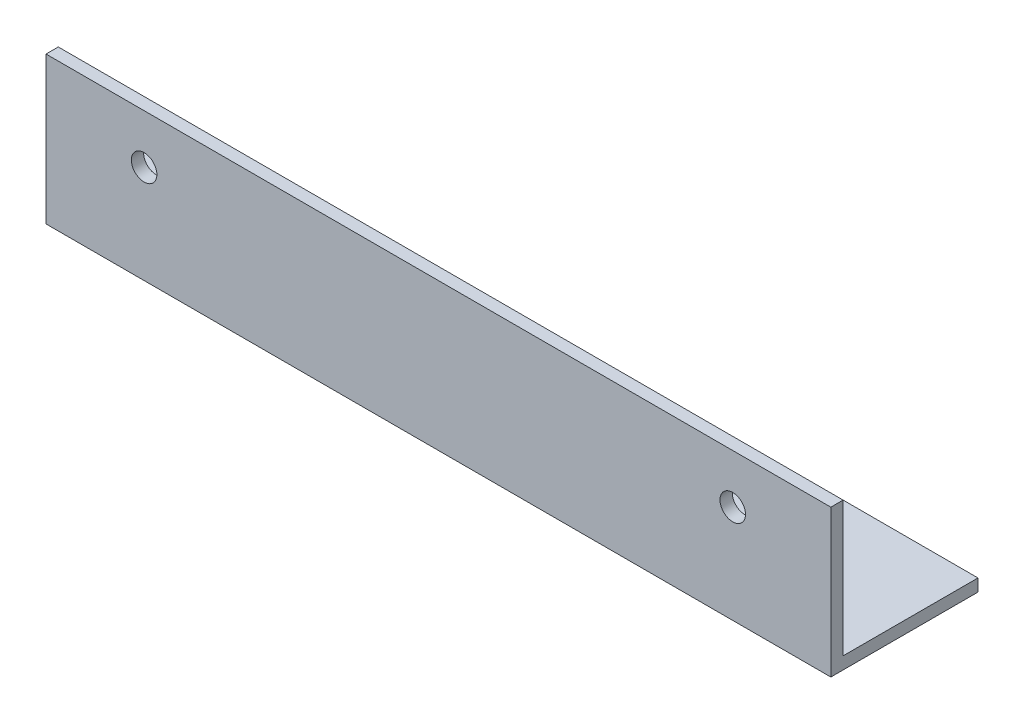
ISO-10303-21;
HEADER;
FILE_DESCRIPTION(('STEP AP214'),'2;1');
FILE_NAME('part.step','',(''),(''),'','','');
FILE_SCHEMA(('AUTOMOTIVE_DESIGN { 1 0 10303 214 1 1 1 1 }'));
ENDSEC;
DATA;
#1=APPLICATION_CONTEXT('core data for automotive mechanical design processes');
#2=APPLICATION_PROTOCOL_DEFINITION('international standard','automotive_design',2000,#1);
#3=PRODUCT_CONTEXT('',#1,'mechanical');
#4=PRODUCT('Part','Part','',(#3));
#5=PRODUCT_RELATED_PRODUCT_CATEGORY('part','',(#4));
#6=PRODUCT_DEFINITION_FORMATION('','',#4);
#7=PRODUCT_DEFINITION_CONTEXT('part definition',#1,'design');
#8=PRODUCT_DEFINITION('design','',#6,#7);
#9=PRODUCT_DEFINITION_SHAPE('','',#8);
#10=(LENGTH_UNIT() NAMED_UNIT(*) SI_UNIT(.MILLI.,.METRE.));
#11=(NAMED_UNIT(*) PLANE_ANGLE_UNIT() SI_UNIT($,.RADIAN.));
#12=(NAMED_UNIT(*) SI_UNIT($,.STERADIAN.) SOLID_ANGLE_UNIT());
#13=UNCERTAINTY_MEASURE_WITH_UNIT(LENGTH_MEASURE(1.E-05),#10,'distance_accuracy_value','');
#14=(GEOMETRIC_REPRESENTATION_CONTEXT(3) GLOBAL_UNCERTAINTY_ASSIGNED_CONTEXT((#13)) GLOBAL_UNIT_ASSIGNED_CONTEXT((#10,
#11,#12)) REPRESENTATION_CONTEXT('',''));
#15=CARTESIAN_POINT('',(0.,0.,0.));
#16=DIRECTION('',(0.,0.,1.));
#17=DIRECTION('',(1.,0.,0.));
#18=AXIS2_PLACEMENT_3D('',#15,#16,#17);
#19=CARTESIAN_POINT('',(76.2,25.4,-3.175));
#20=DIRECTION('',(0.,0.,1.));
#21=DIRECTION('',(1.,0.,0.));
#22=AXIS2_PLACEMENT_3D('',#19,#20,#21);
#23=CYLINDRICAL_SURFACE('',#22,3.302);
#24=CARTESIAN_POINT('',(76.2,25.4,-3.175));
#25=DIRECTION('',(0.,0.,1.));
#26=DIRECTION('',(1.,0.,0.));
#27=AXIS2_PLACEMENT_3D('',#24,#25,#26);
#28=CIRCLE('',#27,3.302);
#29=CARTESIAN_POINT('',(79.502,25.4,-3.175));
#30=VERTEX_POINT('',#29);
#31=EDGE_CURVE('E20',#30,#30,#28,.T.);
#32=ORIENTED_EDGE('',*,*,#31,.F.);
#33=EDGE_LOOP('',(#32));
#34=FACE_BOUND('',#33,.T.);
#35=CARTESIAN_POINT('',(76.2,25.4,0.));
#36=DIRECTION('',(0.,0.,1.));
#37=DIRECTION('',(1.,0.,0.));
#38=AXIS2_PLACEMENT_3D('',#35,#36,#37);
#39=CIRCLE('',#38,3.302);
#40=CARTESIAN_POINT('',(79.502,25.4,0.));
#41=VERTEX_POINT('',#40);
#42=EDGE_CURVE('E103',#41,#41,#39,.F.);
#43=ORIENTED_EDGE('',*,*,#42,.F.);
#44=EDGE_LOOP('',(#43));
#45=FACE_BOUND('',#44,.T.);
#46=ADVANCED_FACE('F17',(#34,#45),#23,.F.);
#47=CARTESIAN_POINT('',(-76.2,25.4,-3.175));
#48=DIRECTION('',(0.,0.,1.));
#49=DIRECTION('',(1.,0.,0.));
#50=AXIS2_PLACEMENT_3D('',#47,#48,#49);
#51=CYLINDRICAL_SURFACE('',#50,3.302);
#52=CARTESIAN_POINT('',(-76.2,25.4,-3.175));
#53=DIRECTION('',(0.,0.,1.));
#54=DIRECTION('',(1.,0.,0.));
#55=AXIS2_PLACEMENT_3D('',#52,#53,#54);
#56=CIRCLE('',#55,3.302);
#57=CARTESIAN_POINT('',(-72.898,25.4,-3.175));
#58=VERTEX_POINT('',#57);
#59=EDGE_CURVE('E98',#58,#58,#56,.T.);
#60=ORIENTED_EDGE('',*,*,#59,.F.);
#61=EDGE_LOOP('',(#60));
#62=FACE_BOUND('',#61,.T.);
#63=CARTESIAN_POINT('',(-76.2,25.4,0.));
#64=DIRECTION('',(0.,0.,1.));
#65=DIRECTION('',(1.,0.,0.));
#66=AXIS2_PLACEMENT_3D('',#63,#64,#65);
#67=CIRCLE('',#66,3.302);
#68=CARTESIAN_POINT('',(-72.898,25.4,0.));
#69=VERTEX_POINT('',#68);
#70=EDGE_CURVE('E100',#69,#69,#67,.F.);
#71=ORIENTED_EDGE('',*,*,#70,.F.);
#72=EDGE_LOOP('',(#71));
#73=FACE_BOUND('',#72,.T.);
#74=ADVANCED_FACE('F117',(#62,#73),#51,.F.);
#75=CARTESIAN_POINT('',(-101.6,3.175,-38.1));
#76=DIRECTION('',(0.,1.,0.));
#77=DIRECTION('',(0.,0.,1.));
#78=AXIS2_PLACEMENT_3D('',#75,#76,#77);
#79=PLANE('',#78);
#80=DIRECTION('',(-1.,0.,0.));
#81=VECTOR('',#80,1.);
#82=CARTESIAN_POINT('',(-101.6,3.175,-38.1));
#83=LINE('',#82,#81);
#84=CARTESIAN_POINT('',(-101.6,3.175,-38.1));
#85=VERTEX_POINT('',#84);
#86=CARTESIAN_POINT('',(101.6,3.175,-38.1));
#87=VERTEX_POINT('',#86);
#88=EDGE_CURVE('E72',#85,#87,#83,.F.);
#89=ORIENTED_EDGE('',*,*,#88,.F.);
#90=DIRECTION('',(0.,0.,-1.));
#91=VECTOR('',#90,1.);
#92=CARTESIAN_POINT('',(-101.6,3.175,0.));
#93=LINE('',#92,#91);
#94=CARTESIAN_POINT('',(-101.6,3.175,-3.175));
#95=VERTEX_POINT('',#94);
#96=EDGE_CURVE('E142',#85,#95,#93,.F.);
#97=ORIENTED_EDGE('',*,*,#96,.T.);
#98=DIRECTION('',(-1.,0.,0.));
#99=VECTOR('',#98,1.);
#100=CARTESIAN_POINT('',(-101.6,3.175,-3.175));
#101=LINE('',#100,#99);
#102=CARTESIAN_POINT('',(101.6,3.175,-3.175));
#103=VERTEX_POINT('',#102);
#104=EDGE_CURVE('E67',#103,#95,#101,.T.);
#105=ORIENTED_EDGE('',*,*,#104,.F.);
#106=DIRECTION('',(0.,0.,-1.));
#107=VECTOR('',#106,1.);
#108=CARTESIAN_POINT('',(101.6,3.175,0.));
#109=LINE('',#108,#107);
#110=EDGE_CURVE('E83',#87,#103,#109,.F.);
#111=ORIENTED_EDGE('',*,*,#110,.F.);
#112=EDGE_LOOP('',(#89,#97,#105,#111));
#113=FACE_BOUND('',#112,.T.);
#114=ADVANCED_FACE('F84',(#113),#79,.T.);
#115=CARTESIAN_POINT('',(-101.6,3.175,-3.175));
#116=DIRECTION('',(0.,0.,-1.));
#117=DIRECTION('',(-1.,0.,0.));
#118=AXIS2_PLACEMENT_3D('',#115,#116,#117);
#119=PLANE('',#118);
#120=ORIENTED_EDGE('',*,*,#59,.T.);
#121=EDGE_LOOP('',(#120));
#122=FACE_BOUND('',#121,.T.);
#123=ORIENTED_EDGE('',*,*,#31,.T.);
#124=EDGE_LOOP('',(#123));
#125=FACE_BOUND('',#124,.T.);
#126=ORIENTED_EDGE('',*,*,#104,.T.);
#127=DIRECTION('',(0.,1.,0.));
#128=VECTOR('',#127,1.);
#129=CARTESIAN_POINT('',(-101.6,0.,-3.175));
#130=LINE('',#129,#128);
#131=CARTESIAN_POINT('',(-101.6,38.1,-3.175));
#132=VERTEX_POINT('',#131);
#133=EDGE_CURVE('E138',#95,#132,#130,.T.);
#134=ORIENTED_EDGE('',*,*,#133,.T.);
#135=DIRECTION('',(1.,0.,0.));
#136=VECTOR('',#135,1.);
#137=CARTESIAN_POINT('',(-101.6,38.1,-3.175));
#138=LINE('',#137,#136);
#139=CARTESIAN_POINT('',(101.6,38.1,-3.175));
#140=VERTEX_POINT('',#139);
#141=EDGE_CURVE('E80',#140,#132,#138,.F.);
#142=ORIENTED_EDGE('',*,*,#141,.F.);
#143=DIRECTION('',(0.,1.,0.));
#144=VECTOR('',#143,1.);
#145=CARTESIAN_POINT('',(101.6,0.,-3.175));
#146=LINE('',#145,#144);
#147=EDGE_CURVE('E87',#103,#140,#146,.T.);
#148=ORIENTED_EDGE('',*,*,#147,.F.);
#149=EDGE_LOOP('',(#126,#134,#142,#148));
#150=FACE_BOUND('',#149,.T.);
#151=ADVANCED_FACE('F112',(#122,#125,#150),#119,.T.);
#152=CARTESIAN_POINT('',(-101.6,38.1,-3.175));
#153=DIRECTION('',(0.,1.,0.));
#154=DIRECTION('',(0.,0.,1.));
#155=AXIS2_PLACEMENT_3D('',#152,#153,#154);
#156=PLANE('',#155);
#157=ORIENTED_EDGE('',*,*,#141,.T.);
#158=DIRECTION('',(0.,0.,-1.));
#159=VECTOR('',#158,1.);
#160=CARTESIAN_POINT('',(-101.6,38.1,0.));
#161=LINE('',#160,#159);
#162=CARTESIAN_POINT('',(-101.6,38.1,0.));
#163=VERTEX_POINT('',#162);
#164=EDGE_CURVE('E133',#132,#163,#161,.F.);
#165=ORIENTED_EDGE('',*,*,#164,.T.);
#166=DIRECTION('',(1.,0.,0.));
#167=VECTOR('',#166,1.);
#168=CARTESIAN_POINT('',(-101.6,38.1,0.));
#169=LINE('',#168,#167);
#170=CARTESIAN_POINT('',(101.6,38.1,0.));
#171=VERTEX_POINT('',#170);
#172=EDGE_CURVE('E105',#171,#163,#169,.F.);
#173=ORIENTED_EDGE('',*,*,#172,.F.);
#174=DIRECTION('',(0.,0.,-1.));
#175=VECTOR('',#174,1.);
#176=CARTESIAN_POINT('',(101.6,38.1,0.));
#177=LINE('',#176,#175);
#178=EDGE_CURVE('E147',#140,#171,#177,.F.);
#179=ORIENTED_EDGE('',*,*,#178,.F.);
#180=EDGE_LOOP('',(#157,#165,#173,#179));
#181=FACE_BOUND('',#180,.T.);
#182=ADVANCED_FACE('F134',(#181),#156,.T.);
#183=CARTESIAN_POINT('',(-101.6,0.,-38.1));
#184=DIRECTION('',(0.,0.,-1.));
#185=DIRECTION('',(-1.,0.,0.));
#186=AXIS2_PLACEMENT_3D('',#183,#184,#185);
#187=PLANE('',#186);
#188=DIRECTION('',(1.,0.,0.));
#189=VECTOR('',#188,1.);
#190=CARTESIAN_POINT('',(-101.6,0.,-38.1));
#191=LINE('',#190,#189);
#192=CARTESIAN_POINT('',(-101.6,0.,-38.1));
#193=VERTEX_POINT('',#192);
#194=CARTESIAN_POINT('',(101.6,0.,-38.1));
#195=VERTEX_POINT('',#194);
#196=EDGE_CURVE('E137',#193,#195,#191,.T.);
#197=ORIENTED_EDGE('',*,*,#196,.F.);
#198=DIRECTION('',(0.,1.,0.));
#199=VECTOR('',#198,1.);
#200=CARTESIAN_POINT('',(-101.6,0.,-38.1));
#201=LINE('',#200,#199);
#202=EDGE_CURVE('E78',#193,#85,#201,.T.);
#203=ORIENTED_EDGE('',*,*,#202,.T.);
#204=ORIENTED_EDGE('',*,*,#88,.T.);
#205=DIRECTION('',(0.,1.,0.));
#206=VECTOR('',#205,1.);
#207=CARTESIAN_POINT('',(101.6,0.,-38.1));
#208=LINE('',#207,#206);
#209=EDGE_CURVE('E75',#195,#87,#208,.T.);
#210=ORIENTED_EDGE('',*,*,#209,.F.);
#211=EDGE_LOOP('',(#197,#203,#204,#210));
#212=FACE_BOUND('',#211,.T.);
#213=ADVANCED_FACE('F73',(#212),#187,.T.);
#214=CARTESIAN_POINT('',(101.6,0.,0.));
#215=DIRECTION('',(1.,0.,0.));
#216=DIRECTION('',(0.,0.,-1.));
#217=AXIS2_PLACEMENT_3D('',#214,#215,#216);
#218=PLANE('',#217);
#219=ORIENTED_EDGE('',*,*,#178,.T.);
#220=DIRECTION('',(0.,1.,0.));
#221=VECTOR('',#220,1.);
#222=CARTESIAN_POINT('',(101.6,38.1,0.));
#223=LINE('',#222,#221);
#224=CARTESIAN_POINT('',(101.6,0.,0.));
#225=VERTEX_POINT('',#224);
#226=EDGE_CURVE('E128',#225,#171,#223,.T.);
#227=ORIENTED_EDGE('',*,*,#226,.F.);
#228=DIRECTION('',(0.,0.,-1.));
#229=VECTOR('',#228,1.);
#230=CARTESIAN_POINT('',(101.6,0.,0.));
#231=LINE('',#230,#229);
#232=EDGE_CURVE('E91',#195,#225,#231,.F.);
#233=ORIENTED_EDGE('',*,*,#232,.F.);
#234=ORIENTED_EDGE('',*,*,#209,.T.);
#235=ORIENTED_EDGE('',*,*,#110,.T.);
#236=ORIENTED_EDGE('',*,*,#147,.T.);
#237=EDGE_LOOP('',(#219,#227,#233,#234,#235,#236));
#238=FACE_BOUND('',#237,.T.);
#239=ADVANCED_FACE('F89',(#238),#218,.T.);
#240=CARTESIAN_POINT('',(-101.6,38.1,0.));
#241=DIRECTION('',(0.,0.,1.));
#242=DIRECTION('',(1.,0.,0.));
#243=AXIS2_PLACEMENT_3D('',#240,#241,#242);
#244=PLANE('',#243);
#245=ORIENTED_EDGE('',*,*,#70,.T.);
#246=EDGE_LOOP('',(#245));
#247=FACE_BOUND('',#246,.T.);
#248=ORIENTED_EDGE('',*,*,#42,.T.);
#249=EDGE_LOOP('',(#248));
#250=FACE_BOUND('',#249,.T.);
#251=ORIENTED_EDGE('',*,*,#172,.T.);
#252=DIRECTION('',(0.,1.,0.));
#253=VECTOR('',#252,1.);
#254=CARTESIAN_POINT('',(-101.6,0.,0.));
#255=LINE('',#254,#253);
#256=CARTESIAN_POINT('',(-101.6,0.,0.));
#257=VERTEX_POINT('',#256);
#258=EDGE_CURVE('E35',#163,#257,#255,.F.);
#259=ORIENTED_EDGE('',*,*,#258,.T.);
#260=DIRECTION('',(1.,0.,0.));
#261=VECTOR('',#260,1.);
#262=CARTESIAN_POINT('',(-101.6,0.,0.));
#263=LINE('',#262,#261);
#264=EDGE_CURVE('E26',#225,#257,#263,.F.);
#265=ORIENTED_EDGE('',*,*,#264,.F.);
#266=ORIENTED_EDGE('',*,*,#226,.T.);
#267=EDGE_LOOP('',(#251,#259,#265,#266));
#268=FACE_BOUND('',#267,.T.);
#269=ADVANCED_FACE('F120',(#247,#250,#268),#244,.T.);
#270=CARTESIAN_POINT('',(-101.6,0.,0.));
#271=DIRECTION('',(1.,0.,0.));
#272=DIRECTION('',(0.,0.,-1.));
#273=AXIS2_PLACEMENT_3D('',#270,#271,#272);
#274=PLANE('',#273);
#275=ORIENTED_EDGE('',*,*,#133,.F.);
#276=ORIENTED_EDGE('',*,*,#96,.F.);
#277=ORIENTED_EDGE('',*,*,#202,.F.);
#278=DIRECTION('',(0.,0.,-1.));
#279=VECTOR('',#278,1.);
#280=CARTESIAN_POINT('',(-101.6,0.,0.));
#281=LINE('',#280,#279);
#282=EDGE_CURVE('E11',#257,#193,#281,.T.);
#283=ORIENTED_EDGE('',*,*,#282,.F.);
#284=ORIENTED_EDGE('',*,*,#258,.F.);
#285=ORIENTED_EDGE('',*,*,#164,.F.);
#286=EDGE_LOOP('',(#275,#276,#277,#283,#284,#285));
#287=FACE_BOUND('',#286,.T.);
#288=ADVANCED_FACE('F122',(#287),#274,.F.);
#289=CARTESIAN_POINT('',(-101.6,0.,0.));
#290=DIRECTION('',(0.,-1.,0.));
#291=DIRECTION('',(0.,0.,-1.));
#292=AXIS2_PLACEMENT_3D('',#289,#290,#291);
#293=PLANE('',#292);
#294=ORIENTED_EDGE('',*,*,#264,.T.);
#295=ORIENTED_EDGE('',*,*,#282,.T.);
#296=ORIENTED_EDGE('',*,*,#196,.T.);
#297=ORIENTED_EDGE('',*,*,#232,.T.);
#298=EDGE_LOOP('',(#294,#295,#296,#297));
#299=FACE_BOUND('',#298,.T.);
#300=ADVANCED_FACE('F153',(#299),#293,.T.);
#301=CLOSED_SHELL('',(#46,#74,#114,#151,#182,#213,#239,#269,#288,#300));
#302=MANIFOLD_SOLID_BREP('B1',#301);
#303=ADVANCED_BREP_SHAPE_REPRESENTATION('',(#18,#302),#14);
#304=SHAPE_DEFINITION_REPRESENTATION(#9,#303);
ENDSEC;
END-ISO-10303-21;
